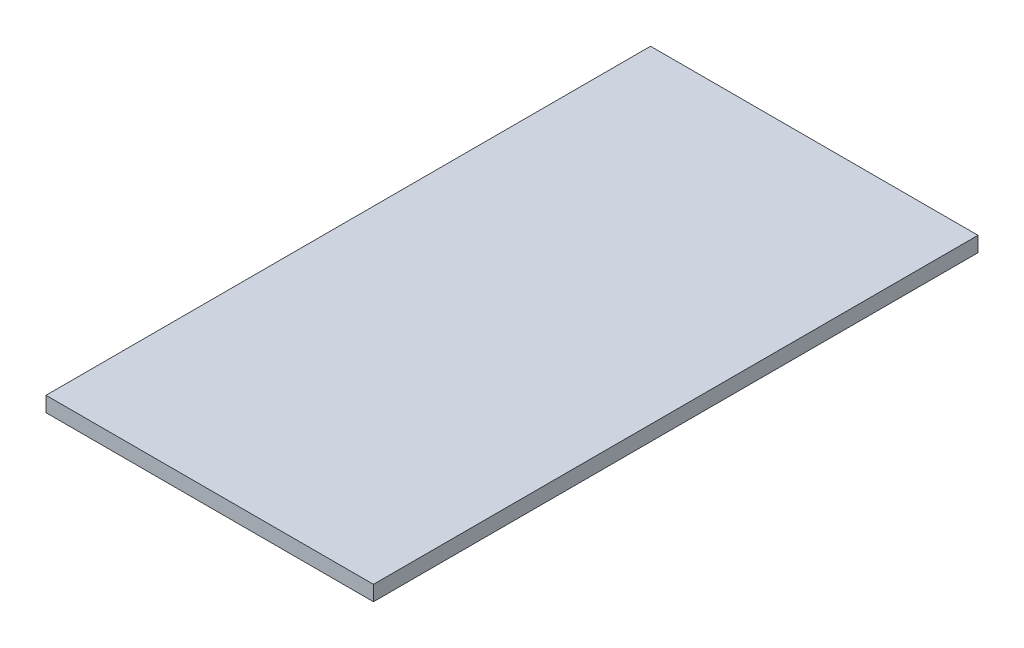
ISO-10303-21;
HEADER;
FILE_DESCRIPTION(('STEP AP214'),'2;1');
FILE_NAME('part.step','',(''),(''),'','','');
FILE_SCHEMA(('AUTOMOTIVE_DESIGN { 1 0 10303 214 1 1 1 1 }'));
ENDSEC;
DATA;
#1=APPLICATION_CONTEXT('core data for automotive mechanical design processes');
#2=APPLICATION_PROTOCOL_DEFINITION('international standard','automotive_design',2000,#1);
#3=PRODUCT_CONTEXT('',#1,'mechanical');
#4=PRODUCT('Part','Part','',(#3));
#5=PRODUCT_RELATED_PRODUCT_CATEGORY('part','',(#4));
#6=PRODUCT_DEFINITION_FORMATION('','',#4);
#7=PRODUCT_DEFINITION_CONTEXT('part definition',#1,'design');
#8=PRODUCT_DEFINITION('design','',#6,#7);
#9=PRODUCT_DEFINITION_SHAPE('','',#8);
#10=(LENGTH_UNIT() NAMED_UNIT(*) SI_UNIT(.MILLI.,.METRE.));
#11=(NAMED_UNIT(*) PLANE_ANGLE_UNIT() SI_UNIT($,.RADIAN.));
#12=(NAMED_UNIT(*) SI_UNIT($,.STERADIAN.) SOLID_ANGLE_UNIT());
#13=UNCERTAINTY_MEASURE_WITH_UNIT(LENGTH_MEASURE(1.E-05),#10,'distance_accuracy_value','');
#14=(GEOMETRIC_REPRESENTATION_CONTEXT(3) GLOBAL_UNCERTAINTY_ASSIGNED_CONTEXT((#13)) GLOBAL_UNIT_ASSIGNED_CONTEXT((#10,
#11,#12)) REPRESENTATION_CONTEXT('',''));
#15=CARTESIAN_POINT('',(0.,0.,0.));
#16=DIRECTION('',(0.,0.,1.));
#17=DIRECTION('',(1.,0.,0.));
#18=AXIS2_PLACEMENT_3D('',#15,#16,#17);
#19=CARTESIAN_POINT('',(-76.9871993960841,2.,-66.2643151829438));
#20=DIRECTION('',(1.,0.,0.));
#21=DIRECTION('',(0.,0.,-1.));
#22=AXIS2_PLACEMENT_3D('',#19,#20,#21);
#23=PLANE('',#22);
#24=DIRECTION('',(0.,0.,1.));
#25=VECTOR('',#24,1.);
#26=CARTESIAN_POINT('',(-76.9871993960841,0.,-66.2643151829438));
#27=LINE('',#26,#25);
#28=CARTESIAN_POINT('',(-76.9871993960841,0.,-66.2643151829438));
#29=VERTEX_POINT('',#28);
#30=CARTESIAN_POINT('',(-76.987199396084,0.,53.7356848170562));
#31=VERTEX_POINT('',#30);
#32=EDGE_CURVE('E80',#29,#31,#27,.T.);
#33=ORIENTED_EDGE('',*,*,#32,.T.);
#34=DIRECTION('',(0.,-1.,0.));
#35=VECTOR('',#34,1.);
#36=CARTESIAN_POINT('',(-76.987199396084,2.,53.7356848170562));
#37=LINE('',#36,#35);
#38=CARTESIAN_POINT('',(-76.987199396084,3.,53.7356848170562));
#39=VERTEX_POINT('',#38);
#40=EDGE_CURVE('E11',#39,#31,#37,.T.);
#41=ORIENTED_EDGE('',*,*,#40,.F.);
#42=DIRECTION('',(0.,0.,1.));
#43=VECTOR('',#42,1.);
#44=CARTESIAN_POINT('',(-76.9871993960841,3.,-66.2643151829438));
#45=LINE('',#44,#43);
#46=CARTESIAN_POINT('',(-76.9871993960841,3.,-66.2643151829438));
#47=VERTEX_POINT('',#46);
#48=EDGE_CURVE('E78',#47,#39,#45,.T.);
#49=ORIENTED_EDGE('',*,*,#48,.F.);
#50=DIRECTION('',(0.,-1.,0.));
#51=VECTOR('',#50,1.);
#52=CARTESIAN_POINT('',(-76.9871993960841,2.,-66.2643151829438));
#53=LINE('',#52,#51);
#54=EDGE_CURVE('E103',#47,#29,#53,.T.);
#55=ORIENTED_EDGE('',*,*,#54,.T.);
#56=EDGE_LOOP('',(#33,#41,#49,#55));
#57=FACE_BOUND('',#56,.T.);
#58=ADVANCED_FACE('F35',(#57),#23,.F.);
#59=CARTESIAN_POINT('',(-76.987199396084,2.,53.7356848170562));
#60=DIRECTION('',(0.,0.,-1.));
#61=DIRECTION('',(-1.,0.,0.));
#62=AXIS2_PLACEMENT_3D('',#59,#60,#61);
#63=PLANE('',#62);
#64=DIRECTION('',(1.,0.,0.));
#65=VECTOR('',#64,1.);
#66=CARTESIAN_POINT('',(-76.987199396084,0.,53.7356848170562));
#67=LINE('',#66,#65);
#68=CARTESIAN_POINT('',(-11.987199396084,0.,53.7356848170562));
#69=VERTEX_POINT('',#68);
#70=EDGE_CURVE('E99',#31,#69,#67,.T.);
#71=ORIENTED_EDGE('',*,*,#70,.T.);
#72=DIRECTION('',(0.,-1.,0.));
#73=VECTOR('',#72,1.);
#74=CARTESIAN_POINT('',(-11.987199396084,2.,53.7356848170562));
#75=LINE('',#74,#73);
#76=CARTESIAN_POINT('',(-11.987199396084,3.,53.7356848170562));
#77=VERTEX_POINT('',#76);
#78=EDGE_CURVE('E42',#77,#69,#75,.T.);
#79=ORIENTED_EDGE('',*,*,#78,.F.);
#80=DIRECTION('',(1.,0.,0.));
#81=VECTOR('',#80,1.);
#82=CARTESIAN_POINT('',(-76.987199396084,3.,53.7356848170562));
#83=LINE('',#82,#81);
#84=EDGE_CURVE('E83',#39,#77,#83,.T.);
#85=ORIENTED_EDGE('',*,*,#84,.F.);
#86=ORIENTED_EDGE('',*,*,#40,.T.);
#87=EDGE_LOOP('',(#71,#79,#85,#86));
#88=FACE_BOUND('',#87,.T.);
#89=ADVANCED_FACE('F84',(#88),#63,.F.);
#90=CARTESIAN_POINT('',(-11.987199396084,2.,-66.2643151829438));
#91=DIRECTION('',(-1.,0.,0.));
#92=DIRECTION('',(0.,0.,1.));
#93=AXIS2_PLACEMENT_3D('',#90,#91,#92);
#94=PLANE('',#93);
#95=DIRECTION('',(0.,0.,-1.));
#96=VECTOR('',#95,1.);
#97=CARTESIAN_POINT('',(-11.987199396084,0.,-66.2643151829438));
#98=LINE('',#97,#96);
#99=CARTESIAN_POINT('',(-11.987199396084,0.,-66.2643151829438));
#100=VERTEX_POINT('',#99);
#101=EDGE_CURVE('E57',#69,#100,#98,.T.);
#102=ORIENTED_EDGE('',*,*,#101,.T.);
#103=DIRECTION('',(0.,-1.,0.));
#104=VECTOR('',#103,1.);
#105=CARTESIAN_POINT('',(-11.987199396084,2.,-66.2643151829438));
#106=LINE('',#105,#104);
#107=CARTESIAN_POINT('',(-11.987199396084,3.,-66.2643151829438));
#108=VERTEX_POINT('',#107);
#109=EDGE_CURVE('E105',#108,#100,#106,.T.);
#110=ORIENTED_EDGE('',*,*,#109,.F.);
#111=DIRECTION('',(0.,0.,-1.));
#112=VECTOR('',#111,1.);
#113=CARTESIAN_POINT('',(-11.987199396084,3.,-66.2643151829438));
#114=LINE('',#113,#112);
#115=EDGE_CURVE('E88',#77,#108,#114,.T.);
#116=ORIENTED_EDGE('',*,*,#115,.F.);
#117=ORIENTED_EDGE('',*,*,#78,.T.);
#118=EDGE_LOOP('',(#102,#110,#116,#117));
#119=FACE_BOUND('',#118,.T.);
#120=ADVANCED_FACE('F106',(#119),#94,.F.);
#121=CARTESIAN_POINT('',(-76.9871993960841,2.,-66.2643151829438));
#122=DIRECTION('',(0.,0.,1.));
#123=DIRECTION('',(1.,0.,0.));
#124=AXIS2_PLACEMENT_3D('',#121,#122,#123);
#125=PLANE('',#124);
#126=DIRECTION('',(-1.,0.,0.));
#127=VECTOR('',#126,1.);
#128=CARTESIAN_POINT('',(-76.9871993960841,0.,-66.2643151829438));
#129=LINE('',#128,#127);
#130=EDGE_CURVE('E49',#100,#29,#129,.T.);
#131=ORIENTED_EDGE('',*,*,#130,.T.);
#132=ORIENTED_EDGE('',*,*,#54,.F.);
#133=DIRECTION('',(-1.,0.,0.));
#134=VECTOR('',#133,1.);
#135=CARTESIAN_POINT('',(-76.9871993960841,3.,-66.2643151829438));
#136=LINE('',#135,#134);
#137=EDGE_CURVE('E93',#108,#47,#136,.T.);
#138=ORIENTED_EDGE('',*,*,#137,.F.);
#139=ORIENTED_EDGE('',*,*,#109,.T.);
#140=EDGE_LOOP('',(#131,#132,#138,#139));
#141=FACE_BOUND('',#140,.T.);
#142=ADVANCED_FACE('F110',(#141),#125,.F.);
#143=CARTESIAN_POINT('',(0.,0.,0.));
#144=DIRECTION('',(0.,1.,0.));
#145=DIRECTION('',(0.,0.,1.));
#146=AXIS2_PLACEMENT_3D('',#143,#144,#145);
#147=PLANE('',#146);
#148=ORIENTED_EDGE('',*,*,#32,.F.);
#149=ORIENTED_EDGE('',*,*,#130,.F.);
#150=ORIENTED_EDGE('',*,*,#101,.F.);
#151=ORIENTED_EDGE('',*,*,#70,.F.);
#152=EDGE_LOOP('',(#148,#149,#150,#151));
#153=FACE_BOUND('',#152,.T.);
#154=ADVANCED_FACE('F108',(#153),#147,.F.);
#155=CARTESIAN_POINT('',(0.,3.,0.));
#156=DIRECTION('',(0.,1.,0.));
#157=DIRECTION('',(0.,0.,1.));
#158=AXIS2_PLACEMENT_3D('',#155,#156,#157);
#159=PLANE('',#158);
#160=ORIENTED_EDGE('',*,*,#48,.T.);
#161=ORIENTED_EDGE('',*,*,#84,.T.);
#162=ORIENTED_EDGE('',*,*,#115,.T.);
#163=ORIENTED_EDGE('',*,*,#137,.T.);
#164=EDGE_LOOP('',(#160,#161,#162,#163));
#165=FACE_BOUND('',#164,.T.);
#166=ADVANCED_FACE('F91',(#165),#159,.T.);
#167=CLOSED_SHELL('',(#58,#89,#120,#142,#154,#166));
#168=MANIFOLD_SOLID_BREP('B2',#167);
#169=ADVANCED_BREP_SHAPE_REPRESENTATION('',(#18,#168),#14);
#170=SHAPE_DEFINITION_REPRESENTATION(#9,#169);
ENDSEC;
END-ISO-10303-21;
